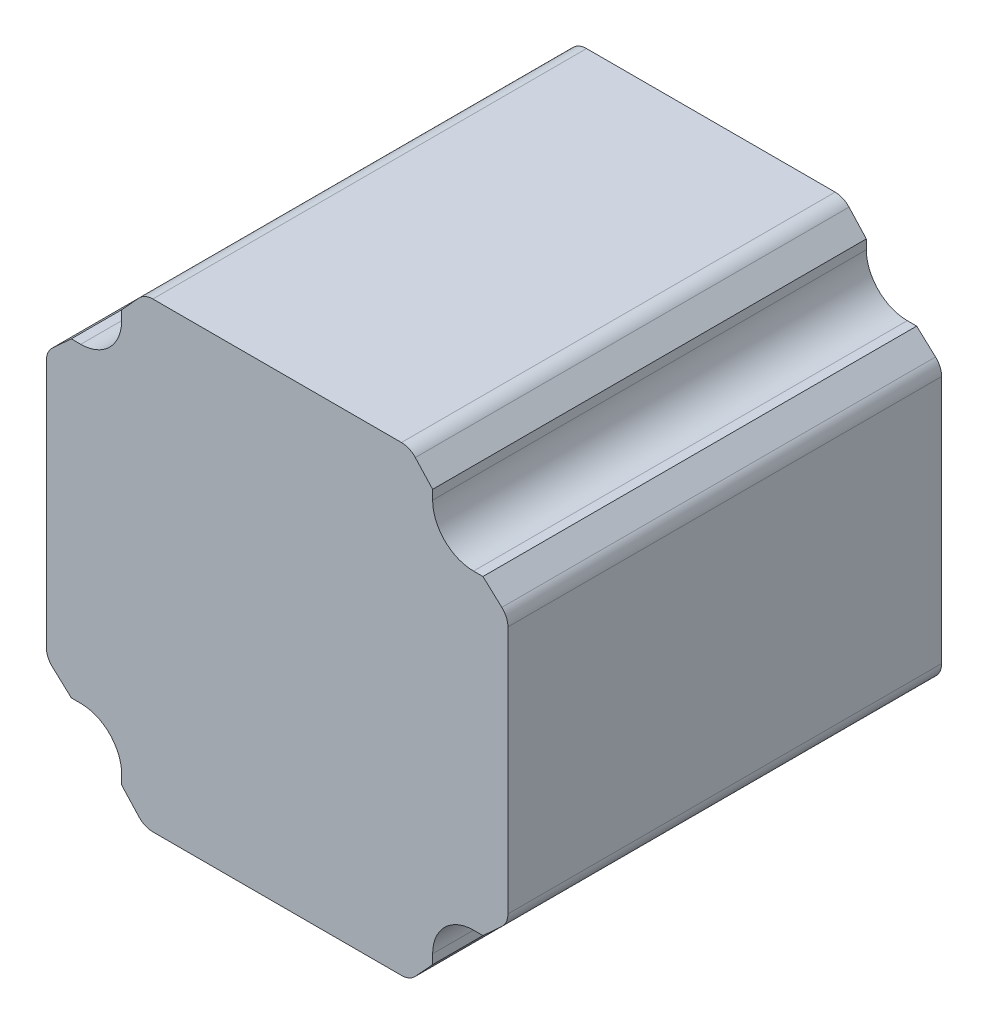
ISO-10303-21;
HEADER;
FILE_DESCRIPTION(('STEP AP214'),'2;1');
FILE_NAME('part.step','',(''),(''),'','','');
FILE_SCHEMA(('AUTOMOTIVE_DESIGN { 1 0 10303 214 1 1 1 1 }'));
ENDSEC;
DATA;
#1=APPLICATION_CONTEXT('core data for automotive mechanical design processes');
#2=APPLICATION_PROTOCOL_DEFINITION('international standard','automotive_design',2000,#1);
#3=PRODUCT_CONTEXT('',#1,'mechanical');
#4=PRODUCT('Part','Part','',(#3));
#5=PRODUCT_RELATED_PRODUCT_CATEGORY('part','',(#4));
#6=PRODUCT_DEFINITION_FORMATION('','',#4);
#7=PRODUCT_DEFINITION_CONTEXT('part definition',#1,'design');
#8=PRODUCT_DEFINITION('design','',#6,#7);
#9=PRODUCT_DEFINITION_SHAPE('','',#8);
#10=(LENGTH_UNIT() NAMED_UNIT(*) SI_UNIT(.MILLI.,.METRE.));
#11=(NAMED_UNIT(*) PLANE_ANGLE_UNIT() SI_UNIT($,.RADIAN.));
#12=(NAMED_UNIT(*) SI_UNIT($,.STERADIAN.) SOLID_ANGLE_UNIT());
#13=UNCERTAINTY_MEASURE_WITH_UNIT(LENGTH_MEASURE(1.E-05),#10,'distance_accuracy_value','');
#14=(GEOMETRIC_REPRESENTATION_CONTEXT(3) GLOBAL_UNCERTAINTY_ASSIGNED_CONTEXT((#13)) GLOBAL_UNIT_ASSIGNED_CONTEXT((#10,
#11,#12)) REPRESENTATION_CONTEXT('',''));
#15=CARTESIAN_POINT('',(0.,0.,0.));
#16=DIRECTION('',(0.,0.,1.));
#17=DIRECTION('',(1.,0.,0.));
#18=AXIS2_PLACEMENT_3D('',#15,#16,#17);
#19=CARTESIAN_POINT('',(24.,19.,53.));
#20=DIRECTION('',(0.,-1.,0.));
#21=DIRECTION('',(0.,0.,-1.));
#22=AXIS2_PLACEMENT_3D('',#19,#20,#21);
#23=PLANE('',#22);
#24=DIRECTION('',(0.,0.,-1.));
#25=VECTOR('',#24,1.);
#26=CARTESIAN_POINT('',(24.,19.,53.));
#27=LINE('',#26,#25);
#28=CARTESIAN_POINT('',(24.,19.,0.));
#29=VERTEX_POINT('',#28);
#30=CARTESIAN_POINT('',(24.,19.,53.));
#31=VERTEX_POINT('',#30);
#32=EDGE_CURVE('E432',#29,#31,#27,.F.);
#33=ORIENTED_EDGE('',*,*,#32,.T.);
#34=DIRECTION('',(1.,0.,0.));
#35=VECTOR('',#34,1.);
#36=CARTESIAN_POINT('',(0.,19.,53.));
#37=LINE('',#36,#35);
#38=CARTESIAN_POINT('',(25.15,19.,53.));
#39=VERTEX_POINT('',#38);
#40=EDGE_CURVE('E264',#39,#31,#37,.F.);
#41=ORIENTED_EDGE('',*,*,#40,.F.);
#42=DIRECTION('',(0.,0.,1.));
#43=VECTOR('',#42,1.);
#44=CARTESIAN_POINT('',(25.15,19.,53.));
#45=LINE('',#44,#43);
#46=CARTESIAN_POINT('',(25.15,19.,0.));
#47=VERTEX_POINT('',#46);
#48=EDGE_CURVE('E224',#39,#47,#45,.F.);
#49=ORIENTED_EDGE('',*,*,#48,.T.);
#50=DIRECTION('',(1.,0.,0.));
#51=VECTOR('',#50,1.);
#52=CARTESIAN_POINT('',(24.,19.,0.));
#53=LINE('',#52,#51);
#54=EDGE_CURVE('E354',#29,#47,#53,.T.);
#55=ORIENTED_EDGE('',*,*,#54,.F.);
#56=EDGE_LOOP('',(#33,#41,#49,#55));
#57=FACE_BOUND('',#56,.T.);
#58=ADVANCED_FACE('F17',(#57),#23,.F.);
#59=CARTESIAN_POINT('',(19.,25.15,53.));
#60=DIRECTION('',(-1.,0.,0.));
#61=DIRECTION('',(0.,0.,1.));
#62=AXIS2_PLACEMENT_3D('',#59,#60,#61);
#63=PLANE('',#62);
#64=DIRECTION('',(0.,0.,1.));
#65=VECTOR('',#64,1.);
#66=CARTESIAN_POINT('',(19.,25.15,53.));
#67=LINE('',#66,#65);
#68=CARTESIAN_POINT('',(19.,25.15,0.));
#69=VERTEX_POINT('',#68);
#70=CARTESIAN_POINT('',(19.,25.15,53.));
#71=VERTEX_POINT('',#70);
#72=EDGE_CURVE('E350',#69,#71,#67,.T.);
#73=ORIENTED_EDGE('',*,*,#72,.T.);
#74=DIRECTION('',(0.,1.,0.));
#75=VECTOR('',#74,1.);
#76=CARTESIAN_POINT('',(19.,0.,53.));
#77=LINE('',#76,#75);
#78=CARTESIAN_POINT('',(19.,24.,53.));
#79=VERTEX_POINT('',#78);
#80=EDGE_CURVE('E259',#79,#71,#77,.T.);
#81=ORIENTED_EDGE('',*,*,#80,.F.);
#82=DIRECTION('',(0.,0.,-1.));
#83=VECTOR('',#82,1.);
#84=CARTESIAN_POINT('',(19.,24.,53.));
#85=LINE('',#84,#83);
#86=CARTESIAN_POINT('',(19.,24.,0.));
#87=VERTEX_POINT('',#86);
#88=EDGE_CURVE('E431',#79,#87,#85,.T.);
#89=ORIENTED_EDGE('',*,*,#88,.T.);
#90=DIRECTION('',(0.,1.,0.));
#91=VECTOR('',#90,1.);
#92=CARTESIAN_POINT('',(19.,25.15,0.));
#93=LINE('',#92,#91);
#94=EDGE_CURVE('E332',#69,#87,#93,.F.);
#95=ORIENTED_EDGE('',*,*,#94,.F.);
#96=EDGE_LOOP('',(#73,#81,#89,#95));
#97=FACE_BOUND('',#96,.T.);
#98=ADVANCED_FACE('F516',(#97),#63,.F.);
#99=CARTESIAN_POINT('',(-19.,24.,53.));
#100=DIRECTION('',(1.,0.,0.));
#101=DIRECTION('',(0.,0.,-1.));
#102=AXIS2_PLACEMENT_3D('',#99,#100,#101);
#103=PLANE('',#102);
#104=DIRECTION('',(0.,0.,-1.));
#105=VECTOR('',#104,1.);
#106=CARTESIAN_POINT('',(-19.,24.,53.));
#107=LINE('',#106,#105);
#108=CARTESIAN_POINT('',(-19.,24.,0.));
#109=VERTEX_POINT('',#108);
#110=CARTESIAN_POINT('',(-19.,24.,53.));
#111=VERTEX_POINT('',#110);
#112=EDGE_CURVE('E426',#109,#111,#107,.F.);
#113=ORIENTED_EDGE('',*,*,#112,.T.);
#114=DIRECTION('',(0.,1.,0.));
#115=VECTOR('',#114,1.);
#116=CARTESIAN_POINT('',(-19.,0.,53.));
#117=LINE('',#116,#115);
#118=CARTESIAN_POINT('',(-19.,25.15,53.));
#119=VERTEX_POINT('',#118);
#120=EDGE_CURVE('E255',#119,#111,#117,.F.);
#121=ORIENTED_EDGE('',*,*,#120,.F.);
#122=DIRECTION('',(0.,0.,1.));
#123=VECTOR('',#122,1.);
#124=CARTESIAN_POINT('',(-19.,25.15,53.));
#125=LINE('',#124,#123);
#126=CARTESIAN_POINT('',(-19.,25.15,0.));
#127=VERTEX_POINT('',#126);
#128=EDGE_CURVE('E338',#119,#127,#125,.F.);
#129=ORIENTED_EDGE('',*,*,#128,.T.);
#130=DIRECTION('',(0.,1.,0.));
#131=VECTOR('',#130,1.);
#132=CARTESIAN_POINT('',(-19.,24.,0.));
#133=LINE('',#132,#131);
#134=EDGE_CURVE('E327',#109,#127,#133,.T.);
#135=ORIENTED_EDGE('',*,*,#134,.F.);
#136=EDGE_LOOP('',(#113,#121,#129,#135));
#137=FACE_BOUND('',#136,.T.);
#138=ADVANCED_FACE('F623',(#137),#103,.F.);
#139=CARTESIAN_POINT('',(-25.15,19.,53.));
#140=DIRECTION('',(0.,-1.,0.));
#141=DIRECTION('',(0.,0.,-1.));
#142=AXIS2_PLACEMENT_3D('',#139,#140,#141);
#143=PLANE('',#142);
#144=DIRECTION('',(0.,0.,1.));
#145=VECTOR('',#144,1.);
#146=CARTESIAN_POINT('',(-25.15,19.,53.));
#147=LINE('',#146,#145);
#148=CARTESIAN_POINT('',(-25.15,19.,0.));
#149=VERTEX_POINT('',#148);
#150=CARTESIAN_POINT('',(-25.15,19.,53.));
#151=VERTEX_POINT('',#150);
#152=EDGE_CURVE('E323',#149,#151,#147,.T.);
#153=ORIENTED_EDGE('',*,*,#152,.T.);
#154=DIRECTION('',(1.,0.,0.));
#155=VECTOR('',#154,1.);
#156=CARTESIAN_POINT('',(0.,19.,53.));
#157=LINE('',#156,#155);
#158=CARTESIAN_POINT('',(-24.,19.,53.));
#159=VERTEX_POINT('',#158);
#160=EDGE_CURVE('E250',#159,#151,#157,.F.);
#161=ORIENTED_EDGE('',*,*,#160,.F.);
#162=DIRECTION('',(0.,0.,-1.));
#163=VECTOR('',#162,1.);
#164=CARTESIAN_POINT('',(-24.,19.,53.));
#165=LINE('',#164,#163);
#166=CARTESIAN_POINT('',(-24.,19.,0.));
#167=VERTEX_POINT('',#166);
#168=EDGE_CURVE('E425',#159,#167,#165,.T.);
#169=ORIENTED_EDGE('',*,*,#168,.T.);
#170=DIRECTION('',(1.,0.,0.));
#171=VECTOR('',#170,1.);
#172=CARTESIAN_POINT('',(-25.15,19.,0.));
#173=LINE('',#172,#171);
#174=EDGE_CURVE('E305',#149,#167,#173,.T.);
#175=ORIENTED_EDGE('',*,*,#174,.F.);
#176=EDGE_LOOP('',(#153,#161,#169,#175));
#177=FACE_BOUND('',#176,.T.);
#178=ADVANCED_FACE('F642',(#177),#143,.F.);
#179=CARTESIAN_POINT('',(-24.,-19.,53.));
#180=DIRECTION('',(0.,1.,0.));
#181=DIRECTION('',(0.,0.,1.));
#182=AXIS2_PLACEMENT_3D('',#179,#180,#181);
#183=PLANE('',#182);
#184=DIRECTION('',(0.,0.,-1.));
#185=VECTOR('',#184,1.);
#186=CARTESIAN_POINT('',(-24.,-19.,53.));
#187=LINE('',#186,#185);
#188=CARTESIAN_POINT('',(-24.,-19.,0.));
#189=VERTEX_POINT('',#188);
#190=CARTESIAN_POINT('',(-24.,-19.,53.));
#191=VERTEX_POINT('',#190);
#192=EDGE_CURVE('E418',#189,#191,#187,.F.);
#193=ORIENTED_EDGE('',*,*,#192,.T.);
#194=DIRECTION('',(1.,0.,0.));
#195=VECTOR('',#194,1.);
#196=CARTESIAN_POINT('',(0.,-19.,53.));
#197=LINE('',#196,#195);
#198=CARTESIAN_POINT('',(-25.15,-19.,53.));
#199=VERTEX_POINT('',#198);
#200=EDGE_CURVE('E246',#199,#191,#197,.T.);
#201=ORIENTED_EDGE('',*,*,#200,.F.);
#202=DIRECTION('',(0.,0.,1.));
#203=VECTOR('',#202,1.);
#204=CARTESIAN_POINT('',(-25.15,-19.,53.));
#205=LINE('',#204,#203);
#206=CARTESIAN_POINT('',(-25.15,-19.,0.));
#207=VERTEX_POINT('',#206);
#208=EDGE_CURVE('E311',#199,#207,#205,.F.);
#209=ORIENTED_EDGE('',*,*,#208,.T.);
#210=DIRECTION('',(1.,0.,0.));
#211=VECTOR('',#210,1.);
#212=CARTESIAN_POINT('',(-24.,-19.,0.));
#213=LINE('',#212,#211);
#214=EDGE_CURVE('E300',#189,#207,#213,.F.);
#215=ORIENTED_EDGE('',*,*,#214,.F.);
#216=EDGE_LOOP('',(#193,#201,#209,#215));
#217=FACE_BOUND('',#216,.T.);
#218=ADVANCED_FACE('F670',(#217),#183,.F.);
#219=CARTESIAN_POINT('',(-19.,-25.15,53.));
#220=DIRECTION('',(1.,0.,0.));
#221=DIRECTION('',(0.,0.,-1.));
#222=AXIS2_PLACEMENT_3D('',#219,#220,#221);
#223=PLANE('',#222);
#224=DIRECTION('',(0.,0.,1.));
#225=VECTOR('',#224,1.);
#226=CARTESIAN_POINT('',(-19.,-25.15,53.));
#227=LINE('',#226,#225);
#228=CARTESIAN_POINT('',(-19.,-25.15,0.));
#229=VERTEX_POINT('',#228);
#230=CARTESIAN_POINT('',(-19.,-25.15,53.));
#231=VERTEX_POINT('',#230);
#232=EDGE_CURVE('E296',#229,#231,#227,.T.);
#233=ORIENTED_EDGE('',*,*,#232,.T.);
#234=DIRECTION('',(0.,1.,0.));
#235=VECTOR('',#234,1.);
#236=CARTESIAN_POINT('',(-19.,0.,53.));
#237=LINE('',#236,#235);
#238=CARTESIAN_POINT('',(-19.,-24.,53.));
#239=VERTEX_POINT('',#238);
#240=EDGE_CURVE('E241',#239,#231,#237,.F.);
#241=ORIENTED_EDGE('',*,*,#240,.F.);
#242=DIRECTION('',(0.,0.,-1.));
#243=VECTOR('',#242,1.);
#244=CARTESIAN_POINT('',(-19.,-24.,53.));
#245=LINE('',#244,#243);
#246=CARTESIAN_POINT('',(-19.,-24.,0.));
#247=VERTEX_POINT('',#246);
#248=EDGE_CURVE('E417',#239,#247,#245,.T.);
#249=ORIENTED_EDGE('',*,*,#248,.T.);
#250=DIRECTION('',(0.,1.,0.));
#251=VECTOR('',#250,1.);
#252=CARTESIAN_POINT('',(-19.,-25.15,0.));
#253=LINE('',#252,#251);
#254=EDGE_CURVE('E277',#229,#247,#253,.T.);
#255=ORIENTED_EDGE('',*,*,#254,.F.);
#256=EDGE_LOOP('',(#233,#241,#249,#255));
#257=FACE_BOUND('',#256,.T.);
#258=ADVANCED_FACE('F604',(#257),#223,.F.);
#259=CARTESIAN_POINT('',(19.,-24.,53.));
#260=DIRECTION('',(-1.,0.,0.));
#261=DIRECTION('',(0.,0.,1.));
#262=AXIS2_PLACEMENT_3D('',#259,#260,#261);
#263=PLANE('',#262);
#264=DIRECTION('',(0.,0.,-1.));
#265=VECTOR('',#264,1.);
#266=CARTESIAN_POINT('',(19.,-24.,53.));
#267=LINE('',#266,#265);
#268=CARTESIAN_POINT('',(19.,-24.,0.));
#269=VERTEX_POINT('',#268);
#270=CARTESIAN_POINT('',(19.,-24.,53.));
#271=VERTEX_POINT('',#270);
#272=EDGE_CURVE('E410',#269,#271,#267,.F.);
#273=ORIENTED_EDGE('',*,*,#272,.T.);
#274=DIRECTION('',(0.,1.,0.));
#275=VECTOR('',#274,1.);
#276=CARTESIAN_POINT('',(19.,0.,53.));
#277=LINE('',#276,#275);
#278=CARTESIAN_POINT('',(19.,-25.15,53.));
#279=VERTEX_POINT('',#278);
#280=EDGE_CURVE('E237',#279,#271,#277,.T.);
#281=ORIENTED_EDGE('',*,*,#280,.F.);
#282=DIRECTION('',(0.,0.,1.));
#283=VECTOR('',#282,1.);
#284=CARTESIAN_POINT('',(19.,-25.15,53.));
#285=LINE('',#284,#283);
#286=CARTESIAN_POINT('',(19.,-25.15,0.));
#287=VERTEX_POINT('',#286);
#288=EDGE_CURVE('E283',#279,#287,#285,.F.);
#289=ORIENTED_EDGE('',*,*,#288,.T.);
#290=DIRECTION('',(0.,1.,0.));
#291=VECTOR('',#290,1.);
#292=CARTESIAN_POINT('',(19.,-24.,0.));
#293=LINE('',#292,#291);
#294=EDGE_CURVE('E272',#269,#287,#293,.F.);
#295=ORIENTED_EDGE('',*,*,#294,.F.);
#296=EDGE_LOOP('',(#273,#281,#289,#295));
#297=FACE_BOUND('',#296,.T.);
#298=ADVANCED_FACE('F580',(#297),#263,.F.);
#299=CARTESIAN_POINT('',(25.15,-19.,53.));
#300=DIRECTION('',(0.,1.,0.));
#301=DIRECTION('',(0.,0.,1.));
#302=AXIS2_PLACEMENT_3D('',#299,#300,#301);
#303=PLANE('',#302);
#304=DIRECTION('',(0.,0.,1.));
#305=VECTOR('',#304,1.);
#306=CARTESIAN_POINT('',(25.15,-19.,53.));
#307=LINE('',#306,#305);
#308=CARTESIAN_POINT('',(25.15,-19.,0.));
#309=VERTEX_POINT('',#308);
#310=CARTESIAN_POINT('',(25.15,-19.,53.));
#311=VERTEX_POINT('',#310);
#312=EDGE_CURVE('E233',#309,#311,#307,.T.);
#313=ORIENTED_EDGE('',*,*,#312,.T.);
#314=DIRECTION('',(1.,0.,0.));
#315=VECTOR('',#314,1.);
#316=CARTESIAN_POINT('',(0.,-19.,53.));
#317=LINE('',#316,#315);
#318=CARTESIAN_POINT('',(24.,-19.,53.));
#319=VERTEX_POINT('',#318);
#320=EDGE_CURVE('E218',#319,#311,#317,.T.);
#321=ORIENTED_EDGE('',*,*,#320,.F.);
#322=DIRECTION('',(0.,0.,-1.));
#323=VECTOR('',#322,1.);
#324=CARTESIAN_POINT('',(24.,-19.,53.));
#325=LINE('',#324,#323);
#326=CARTESIAN_POINT('',(24.,-19.,0.));
#327=VERTEX_POINT('',#326);
#328=EDGE_CURVE('E409',#319,#327,#325,.T.);
#329=ORIENTED_EDGE('',*,*,#328,.T.);
#330=DIRECTION('',(1.,0.,0.));
#331=VECTOR('',#330,1.);
#332=CARTESIAN_POINT('',(25.15,-19.,0.));
#333=LINE('',#332,#331);
#334=EDGE_CURVE('E268',#309,#327,#333,.F.);
#335=ORIENTED_EDGE('',*,*,#334,.F.);
#336=EDGE_LOOP('',(#313,#321,#329,#335));
#337=FACE_BOUND('',#336,.T.);
#338=ADVANCED_FACE('F568',(#337),#303,.F.);
#339=CARTESIAN_POINT('',(0.,0.,53.));
#340=DIRECTION('',(0.,0.,1.));
#341=DIRECTION('',(1.,0.,0.));
#342=AXIS2_PLACEMENT_3D('',#339,#340,#341);
#343=PLANE('',#342);
#344=ORIENTED_EDGE('',*,*,#320,.T.);
#345=DIRECTION('',(-0.736652658103118,-0.67627129268483,0.));
#346=VECTOR('',#345,1.);
#347=CARTESIAN_POINT('',(28.2,-16.2,53.));
#348=LINE('',#347,#346);
#349=CARTESIAN_POINT('',(27.4554239731751,-16.883545204954,53.));
#350=VERTEX_POINT('',#349);
#351=EDGE_CURVE('E230',#311,#350,#348,.F.);
#352=ORIENTED_EDGE('',*,*,#351,.T.);
#353=CARTESIAN_POINT('',(25.9,-15.1892440913168,53.));
#354=DIRECTION('',(0.,0.,-1.));
#355=DIRECTION('',(-1.,0.,0.));
#356=AXIS2_PLACEMENT_3D('',#353,#354,#355);
#357=CIRCLE('',#356,2.3);
#358=CARTESIAN_POINT('',(28.2,-15.1892440913168,53.));
#359=VERTEX_POINT('',#358);
#360=EDGE_CURVE('E214',#359,#350,#357,.T.);
#361=ORIENTED_EDGE('',*,*,#360,.F.);
#362=DIRECTION('',(0.,1.,0.));
#363=VECTOR('',#362,1.);
#364=CARTESIAN_POINT('',(28.2,28.2,53.));
#365=LINE('',#364,#363);
#366=CARTESIAN_POINT('',(28.2,15.1892440913168,53.));
#367=VERTEX_POINT('',#366);
#368=EDGE_CURVE('E209',#367,#359,#365,.F.);
#369=ORIENTED_EDGE('',*,*,#368,.F.);
#370=CARTESIAN_POINT('',(25.9,15.1892440913168,53.));
#371=DIRECTION('',(0.,0.,1.));
#372=DIRECTION('',(1.,0.,0.));
#373=AXIS2_PLACEMENT_3D('',#370,#371,#372);
#374=CIRCLE('',#373,2.3);
#375=CARTESIAN_POINT('',(27.4554239731751,16.883545204954,53.));
#376=VERTEX_POINT('',#375);
#377=EDGE_CURVE('E20',#376,#367,#374,.F.);
#378=ORIENTED_EDGE('',*,*,#377,.F.);
#379=DIRECTION('',(0.736652658103118,-0.67627129268483,0.));
#380=VECTOR('',#379,1.);
#381=CARTESIAN_POINT('',(25.15,19.,53.));
#382=LINE('',#381,#380);
#383=EDGE_CURVE('E194',#376,#39,#382,.F.);
#384=ORIENTED_EDGE('',*,*,#383,.T.);
#385=ORIENTED_EDGE('',*,*,#40,.T.);
#386=CARTESIAN_POINT('',(24.,24.,53.));
#387=DIRECTION('',(0.,0.,-1.));
#388=DIRECTION('',(-1.,0.,0.));
#389=AXIS2_PLACEMENT_3D('',#386,#387,#388);
#390=CIRCLE('',#389,5.);
#391=EDGE_CURVE('E429',#31,#79,#390,.T.);
#392=ORIENTED_EDGE('',*,*,#391,.T.);
#393=ORIENTED_EDGE('',*,*,#80,.T.);
#394=DIRECTION('',(0.67627129268483,-0.736652658103118,0.));
#395=VECTOR('',#394,1.);
#396=CARTESIAN_POINT('',(16.2,28.2,53.));
#397=LINE('',#396,#395);
#398=CARTESIAN_POINT('',(16.883545204954,27.4554239731751,53.));
#399=VERTEX_POINT('',#398);
#400=EDGE_CURVE('E346',#71,#399,#397,.F.);
#401=ORIENTED_EDGE('',*,*,#400,.T.);
#402=CARTESIAN_POINT('',(15.1892440913168,25.9,53.));
#403=DIRECTION('',(0.,0.,-1.));
#404=DIRECTION('',(-1.,0.,0.));
#405=AXIS2_PLACEMENT_3D('',#402,#403,#404);
#406=CIRCLE('',#405,2.3);
#407=CARTESIAN_POINT('',(15.1892440913168,28.2,53.));
#408=VERTEX_POINT('',#407);
#409=EDGE_CURVE('E349',#408,#399,#406,.T.);
#410=ORIENTED_EDGE('',*,*,#409,.F.);
#411=DIRECTION('',(1.,0.,0.));
#412=VECTOR('',#411,1.);
#413=CARTESIAN_POINT('',(-28.2,28.2,53.));
#414=LINE('',#413,#412);
#415=CARTESIAN_POINT('',(-15.1892440913168,28.2,53.));
#416=VERTEX_POINT('',#415);
#417=EDGE_CURVE('E342',#416,#408,#414,.T.);
#418=ORIENTED_EDGE('',*,*,#417,.F.);
#419=CARTESIAN_POINT('',(-15.1892440913168,25.9,53.));
#420=DIRECTION('',(0.,0.,1.));
#421=DIRECTION('',(1.,0.,0.));
#422=AXIS2_PLACEMENT_3D('',#419,#420,#421);
#423=CIRCLE('',#422,2.3);
#424=CARTESIAN_POINT('',(-16.883545204954,27.4554239731751,53.));
#425=VERTEX_POINT('',#424);
#426=EDGE_CURVE('E427',#425,#416,#423,.F.);
#427=ORIENTED_EDGE('',*,*,#426,.F.);
#428=DIRECTION('',(0.67627129268483,0.736652658103118,0.));
#429=VECTOR('',#428,1.);
#430=CARTESIAN_POINT('',(-19.,25.15,53.));
#431=LINE('',#430,#429);
#432=EDGE_CURVE('E335',#425,#119,#431,.F.);
#433=ORIENTED_EDGE('',*,*,#432,.T.);
#434=ORIENTED_EDGE('',*,*,#120,.T.);
#435=CARTESIAN_POINT('',(-24.,24.,53.));
#436=DIRECTION('',(0.,0.,-1.));
#437=DIRECTION('',(-1.,0.,0.));
#438=AXIS2_PLACEMENT_3D('',#435,#436,#437);
#439=CIRCLE('',#438,5.);
#440=EDGE_CURVE('E422',#111,#159,#439,.T.);
#441=ORIENTED_EDGE('',*,*,#440,.T.);
#442=ORIENTED_EDGE('',*,*,#160,.T.);
#443=DIRECTION('',(0.736652658103118,0.67627129268483,0.));
#444=VECTOR('',#443,1.);
#445=CARTESIAN_POINT('',(-28.2,16.2,53.));
#446=LINE('',#445,#444);
#447=CARTESIAN_POINT('',(-27.4554239731751,16.883545204954,53.));
#448=VERTEX_POINT('',#447);
#449=EDGE_CURVE('E319',#151,#448,#446,.F.);
#450=ORIENTED_EDGE('',*,*,#449,.T.);
#451=CARTESIAN_POINT('',(-25.9,15.1892440913168,53.));
#452=DIRECTION('',(0.,0.,-1.));
#453=DIRECTION('',(-1.,0.,0.));
#454=AXIS2_PLACEMENT_3D('',#451,#452,#453);
#455=CIRCLE('',#454,2.3);
#456=CARTESIAN_POINT('',(-28.2,15.1892440913168,53.));
#457=VERTEX_POINT('',#456);
#458=EDGE_CURVE('E322',#457,#448,#455,.T.);
#459=ORIENTED_EDGE('',*,*,#458,.F.);
#460=DIRECTION('',(0.,1.,0.));
#461=VECTOR('',#460,1.);
#462=CARTESIAN_POINT('',(-28.2,-28.2,53.));
#463=LINE('',#462,#461);
#464=CARTESIAN_POINT('',(-28.2,-15.1892440913168,53.));
#465=VERTEX_POINT('',#464);
#466=EDGE_CURVE('E315',#465,#457,#463,.T.);
#467=ORIENTED_EDGE('',*,*,#466,.F.);
#468=CARTESIAN_POINT('',(-25.9,-15.1892440913168,53.));
#469=DIRECTION('',(0.,0.,1.));
#470=DIRECTION('',(1.,0.,0.));
#471=AXIS2_PLACEMENT_3D('',#468,#469,#470);
#472=CIRCLE('',#471,2.3);
#473=CARTESIAN_POINT('',(-27.4554239731751,-16.883545204954,53.));
#474=VERTEX_POINT('',#473);
#475=EDGE_CURVE('E419',#474,#465,#472,.F.);
#476=ORIENTED_EDGE('',*,*,#475,.F.);
#477=DIRECTION('',(-0.736652658103118,0.67627129268483,0.));
#478=VECTOR('',#477,1.);
#479=CARTESIAN_POINT('',(-25.15,-19.,53.));
#480=LINE('',#479,#478);
#481=EDGE_CURVE('E308',#474,#199,#480,.F.);
#482=ORIENTED_EDGE('',*,*,#481,.T.);
#483=ORIENTED_EDGE('',*,*,#200,.T.);
#484=CARTESIAN_POINT('',(-24.,-24.,53.));
#485=DIRECTION('',(0.,0.,-1.));
#486=DIRECTION('',(-1.,0.,0.));
#487=AXIS2_PLACEMENT_3D('',#484,#485,#486);
#488=CIRCLE('',#487,5.);
#489=EDGE_CURVE('E414',#191,#239,#488,.T.);
#490=ORIENTED_EDGE('',*,*,#489,.T.);
#491=ORIENTED_EDGE('',*,*,#240,.T.);
#492=DIRECTION('',(-0.67627129268483,0.736652658103118,0.));
#493=VECTOR('',#492,1.);
#494=CARTESIAN_POINT('',(-16.2,-28.2,53.));
#495=LINE('',#494,#493);
#496=CARTESIAN_POINT('',(-16.883545204954,-27.4554239731751,53.));
#497=VERTEX_POINT('',#496);
#498=EDGE_CURVE('E292',#231,#497,#495,.F.);
#499=ORIENTED_EDGE('',*,*,#498,.T.);
#500=CARTESIAN_POINT('',(-15.1892440913168,-25.9,53.));
#501=DIRECTION('',(0.,0.,-1.));
#502=DIRECTION('',(-1.,0.,0.));
#503=AXIS2_PLACEMENT_3D('',#500,#501,#502);
#504=CIRCLE('',#503,2.3);
#505=CARTESIAN_POINT('',(-15.1892440913168,-28.2,53.));
#506=VERTEX_POINT('',#505);
#507=EDGE_CURVE('E295',#506,#497,#504,.T.);
#508=ORIENTED_EDGE('',*,*,#507,.F.);
#509=DIRECTION('',(1.,0.,0.));
#510=VECTOR('',#509,1.);
#511=CARTESIAN_POINT('',(28.2,-28.2,53.));
#512=LINE('',#511,#510);
#513=CARTESIAN_POINT('',(15.1892440913168,-28.2,53.));
#514=VERTEX_POINT('',#513);
#515=EDGE_CURVE('E287',#514,#506,#512,.F.);
#516=ORIENTED_EDGE('',*,*,#515,.F.);
#517=CARTESIAN_POINT('',(15.1892440913168,-25.9,53.));
#518=DIRECTION('',(0.,0.,1.));
#519=DIRECTION('',(1.,0.,0.));
#520=AXIS2_PLACEMENT_3D('',#517,#518,#519);
#521=CIRCLE('',#520,2.3);
#522=CARTESIAN_POINT('',(16.883545204954,-27.4554239731751,53.));
#523=VERTEX_POINT('',#522);
#524=EDGE_CURVE('E290',#523,#514,#521,.F.);
#525=ORIENTED_EDGE('',*,*,#524,.F.);
#526=DIRECTION('',(-0.67627129268483,-0.736652658103118,0.));
#527=VECTOR('',#526,1.);
#528=CARTESIAN_POINT('',(19.,-25.15,53.));
#529=LINE('',#528,#527);
#530=EDGE_CURVE('E280',#523,#279,#529,.F.);
#531=ORIENTED_EDGE('',*,*,#530,.T.);
#532=ORIENTED_EDGE('',*,*,#280,.T.);
#533=CARTESIAN_POINT('',(24.,-24.,53.));
#534=DIRECTION('',(0.,0.,-1.));
#535=DIRECTION('',(-1.,0.,0.));
#536=AXIS2_PLACEMENT_3D('',#533,#534,#535);
#537=CIRCLE('',#536,5.);
#538=EDGE_CURVE('E406',#271,#319,#537,.T.);
#539=ORIENTED_EDGE('',*,*,#538,.T.);
#540=EDGE_LOOP('',(#344,#352,#361,#369,#378,#384,#385,#392,#393,#401,#410,#418,#427,#433,#434,
#441,#442,#450,#459,#467,#476,#482,#483,#490,#491,#499,#508,#516,#525,#531,#532,#539));
#541=FACE_BOUND('',#540,.T.);
#542=ADVANCED_FACE('F212',(#541),#343,.T.);
#543=CARTESIAN_POINT('',(28.2,28.2,0.));
#544=DIRECTION('',(1.,0.,0.));
#545=DIRECTION('',(0.,0.,-1.));
#546=AXIS2_PLACEMENT_3D('',#543,#544,#545);
#547=PLANE('',#546);
#548=DIRECTION('',(0.,0.,1.));
#549=VECTOR('',#548,1.);
#550=CARTESIAN_POINT('',(28.2,15.1892440913168,26.5));
#551=LINE('',#550,#549);
#552=CARTESIAN_POINT('',(28.2,15.1892440913168,0.));
#553=VERTEX_POINT('',#552);
#554=EDGE_CURVE('E205',#367,#553,#551,.F.);
#555=ORIENTED_EDGE('',*,*,#554,.F.);
#556=ORIENTED_EDGE('',*,*,#368,.T.);
#557=DIRECTION('',(0.,0.,-1.));
#558=VECTOR('',#557,1.);
#559=CARTESIAN_POINT('',(28.2,-15.1892440913168,26.5));
#560=LINE('',#559,#558);
#561=CARTESIAN_POINT('',(28.2,-15.1892440913168,0.));
#562=VERTEX_POINT('',#561);
#563=EDGE_CURVE('E232',#562,#359,#560,.F.);
#564=ORIENTED_EDGE('',*,*,#563,.F.);
#565=DIRECTION('',(0.,1.,0.));
#566=VECTOR('',#565,1.);
#567=CARTESIAN_POINT('',(28.2,0.,0.));
#568=LINE('',#567,#566);
#569=EDGE_CURVE('E222',#562,#553,#568,.T.);
#570=ORIENTED_EDGE('',*,*,#569,.T.);
#571=EDGE_LOOP('',(#555,#556,#564,#570));
#572=FACE_BOUND('',#571,.T.);
#573=ADVANCED_FACE('F221',(#572),#547,.T.);
#574=CARTESIAN_POINT('',(25.9,15.1892440913168,26.5));
#575=DIRECTION('',(0.,0.,1.));
#576=DIRECTION('',(1.,0.,0.));
#577=AXIS2_PLACEMENT_3D('',#574,#575,#576);
#578=CYLINDRICAL_SURFACE('',#577,2.3);
#579=CARTESIAN_POINT('',(25.9,15.1892440913168,0.));
#580=DIRECTION('',(0.,0.,1.));
#581=DIRECTION('',(1.,0.,0.));
#582=AXIS2_PLACEMENT_3D('',#579,#580,#581);
#583=CIRCLE('',#582,2.3);
#584=CARTESIAN_POINT('',(27.4554239731751,16.883545204954,0.));
#585=VERTEX_POINT('',#584);
#586=EDGE_CURVE('E403',#553,#585,#583,.T.);
#587=ORIENTED_EDGE('',*,*,#586,.T.);
#588=DIRECTION('',(0.,0.,1.));
#589=VECTOR('',#588,1.);
#590=CARTESIAN_POINT('',(27.4554239731751,16.883545204954,53.));
#591=LINE('',#590,#589);
#592=EDGE_CURVE('E207',#585,#376,#591,.T.);
#593=ORIENTED_EDGE('',*,*,#592,.T.);
#594=ORIENTED_EDGE('',*,*,#377,.T.);
#595=ORIENTED_EDGE('',*,*,#554,.T.);
#596=EDGE_LOOP('',(#587,#593,#594,#595));
#597=FACE_BOUND('',#596,.T.);
#598=ADVANCED_FACE('F203',(#597),#578,.T.);
#599=CARTESIAN_POINT('',(25.15,19.,53.));
#600=DIRECTION('',(-0.67627129268483,-0.736652658103118,0.));
#601=DIRECTION('',(0.736652658103118,-0.67627129268483,0.));
#602=AXIS2_PLACEMENT_3D('',#599,#600,#601);
#603=PLANE('',#602);
#604=DIRECTION('',(-0.736652658103119,0.676271292684828,0.));
#605=VECTOR('',#604,1.);
#606=CARTESIAN_POINT('',(27.4554239731751,16.883545204954,0.));
#607=LINE('',#606,#605);
#608=EDGE_CURVE('E402',#585,#47,#607,.T.);
#609=ORIENTED_EDGE('',*,*,#608,.T.);
#610=ORIENTED_EDGE('',*,*,#48,.F.);
#611=ORIENTED_EDGE('',*,*,#383,.F.);
#612=ORIENTED_EDGE('',*,*,#592,.F.);
#613=EDGE_LOOP('',(#609,#610,#611,#612));
#614=FACE_BOUND('',#613,.T.);
#615=ADVANCED_FACE('F445',(#614),#603,.F.);
#616=CARTESIAN_POINT('',(24.,24.,53.));
#617=DIRECTION('',(0.,0.,-1.));
#618=DIRECTION('',(-1.,0.,0.));
#619=AXIS2_PLACEMENT_3D('',#616,#617,#618);
#620=CYLINDRICAL_SURFACE('',#619,5.);
#621=ORIENTED_EDGE('',*,*,#88,.F.);
#622=ORIENTED_EDGE('',*,*,#391,.F.);
#623=ORIENTED_EDGE('',*,*,#32,.F.);
#624=CARTESIAN_POINT('',(24.,24.,0.));
#625=DIRECTION('',(0.,0.,-1.));
#626=DIRECTION('',(-1.,0.,0.));
#627=AXIS2_PLACEMENT_3D('',#624,#625,#626);
#628=CIRCLE('',#627,5.);
#629=EDGE_CURVE('E399',#29,#87,#628,.T.);
#630=ORIENTED_EDGE('',*,*,#629,.T.);
#631=EDGE_LOOP('',(#621,#622,#623,#630));
#632=FACE_BOUND('',#631,.T.);
#633=ADVANCED_FACE('F838',(#632),#620,.F.);
#634=CARTESIAN_POINT('',(16.2,28.2,53.));
#635=DIRECTION('',(-0.736652658103118,-0.67627129268483,0.));
#636=DIRECTION('',(0.67627129268483,-0.736652658103118,0.));
#637=AXIS2_PLACEMENT_3D('',#634,#635,#636);
#638=PLANE('',#637);
#639=ORIENTED_EDGE('',*,*,#400,.F.);
#640=ORIENTED_EDGE('',*,*,#72,.F.);
#641=DIRECTION('',(-0.676271292684827,0.736652658103121,0.));
#642=VECTOR('',#641,1.);
#643=CARTESIAN_POINT('',(19.,25.15,0.));
#644=LINE('',#643,#642);
#645=CARTESIAN_POINT('',(16.883545204954,27.4554239731751,0.));
#646=VERTEX_POINT('',#645);
#647=EDGE_CURVE('E398',#69,#646,#644,.T.);
#648=ORIENTED_EDGE('',*,*,#647,.T.);
#649=DIRECTION('',(0.,0.,-1.));
#650=VECTOR('',#649,1.);
#651=CARTESIAN_POINT('',(16.883545204954,27.4554239731751,26.5));
#652=LINE('',#651,#650);
#653=EDGE_CURVE('E345',#399,#646,#652,.T.);
#654=ORIENTED_EDGE('',*,*,#653,.F.);
#655=EDGE_LOOP('',(#639,#640,#648,#654));
#656=FACE_BOUND('',#655,.T.);
#657=ADVANCED_FACE('F523',(#656),#638,.F.);
#658=CARTESIAN_POINT('',(15.1892440913168,25.9,26.5));
#659=DIRECTION('',(0.,0.,-1.));
#660=DIRECTION('',(-1.,0.,0.));
#661=AXIS2_PLACEMENT_3D('',#658,#659,#660);
#662=CYLINDRICAL_SURFACE('',#661,2.3);
#663=ORIENTED_EDGE('',*,*,#409,.T.);
#664=ORIENTED_EDGE('',*,*,#653,.T.);
#665=CARTESIAN_POINT('',(15.1892440913168,25.9,0.));
#666=DIRECTION('',(0.,0.,-1.));
#667=DIRECTION('',(-1.,0.,0.));
#668=AXIS2_PLACEMENT_3D('',#665,#666,#667);
#669=CIRCLE('',#668,2.3);
#670=CARTESIAN_POINT('',(15.1892440913168,28.2,0.));
#671=VERTEX_POINT('',#670);
#672=EDGE_CURVE('E395',#646,#671,#669,.F.);
#673=ORIENTED_EDGE('',*,*,#672,.T.);
#674=DIRECTION('',(0.,0.,1.));
#675=VECTOR('',#674,1.);
#676=CARTESIAN_POINT('',(15.1892440913168,28.2,0.));
#677=LINE('',#676,#675);
#678=EDGE_CURVE('E344',#408,#671,#677,.F.);
#679=ORIENTED_EDGE('',*,*,#678,.F.);
#680=EDGE_LOOP('',(#663,#664,#673,#679));
#681=FACE_BOUND('',#680,.T.);
#682=ADVANCED_FACE('F636',(#681),#662,.T.);
#683=CARTESIAN_POINT('',(-28.2,28.2,0.));
#684=DIRECTION('',(0.,1.,0.));
#685=DIRECTION('',(0.,0.,1.));
#686=AXIS2_PLACEMENT_3D('',#683,#684,#685);
#687=PLANE('',#686);
#688=ORIENTED_EDGE('',*,*,#678,.T.);
#689=DIRECTION('',(1.,0.,0.));
#690=VECTOR('',#689,1.);
#691=CARTESIAN_POINT('',(0.,28.2,0.));
#692=LINE('',#691,#690);
#693=CARTESIAN_POINT('',(-15.1892440913168,28.2,0.));
#694=VERTEX_POINT('',#693);
#695=EDGE_CURVE('E394',#671,#694,#692,.F.);
#696=ORIENTED_EDGE('',*,*,#695,.T.);
#697=DIRECTION('',(0.,0.,1.));
#698=VECTOR('',#697,1.);
#699=CARTESIAN_POINT('',(-15.1892440913168,28.2,26.5));
#700=LINE('',#699,#698);
#701=EDGE_CURVE('E339',#416,#694,#700,.F.);
#702=ORIENTED_EDGE('',*,*,#701,.F.);
#703=ORIENTED_EDGE('',*,*,#417,.T.);
#704=EDGE_LOOP('',(#688,#696,#702,#703));
#705=FACE_BOUND('',#704,.T.);
#706=ADVANCED_FACE('F632',(#705),#687,.T.);
#707=CARTESIAN_POINT('',(-15.1892440913168,25.9,26.5));
#708=DIRECTION('',(0.,0.,1.));
#709=DIRECTION('',(1.,0.,0.));
#710=AXIS2_PLACEMENT_3D('',#707,#708,#709);
#711=CYLINDRICAL_SURFACE('',#710,2.3);
#712=CARTESIAN_POINT('',(-15.1892440913168,25.9,0.));
#713=DIRECTION('',(0.,0.,1.));
#714=DIRECTION('',(1.,0.,0.));
#715=AXIS2_PLACEMENT_3D('',#712,#713,#714);
#716=CIRCLE('',#715,2.3);
#717=CARTESIAN_POINT('',(-16.883545204954,27.4554239731751,0.));
#718=VERTEX_POINT('',#717);
#719=EDGE_CURVE('E391',#694,#718,#716,.T.);
#720=ORIENTED_EDGE('',*,*,#719,.T.);
#721=DIRECTION('',(0.,0.,1.));
#722=VECTOR('',#721,1.);
#723=CARTESIAN_POINT('',(-16.883545204954,27.4554239731751,53.));
#724=LINE('',#723,#722);
#725=EDGE_CURVE('E501',#718,#425,#724,.T.);
#726=ORIENTED_EDGE('',*,*,#725,.T.);
#727=ORIENTED_EDGE('',*,*,#426,.T.);
#728=ORIENTED_EDGE('',*,*,#701,.T.);
#729=EDGE_LOOP('',(#720,#726,#727,#728));
#730=FACE_BOUND('',#729,.T.);
#731=ADVANCED_FACE('F628',(#730),#711,.T.);
#732=CARTESIAN_POINT('',(-19.,25.15,53.));
#733=DIRECTION('',(0.736652658103118,-0.67627129268483,0.));
#734=DIRECTION('',(0.67627129268483,0.736652658103118,0.));
#735=AXIS2_PLACEMENT_3D('',#732,#733,#734);
#736=PLANE('',#735);
#737=DIRECTION('',(-0.676271292684829,-0.736652658103118,0.));
#738=VECTOR('',#737,1.);
#739=CARTESIAN_POINT('',(-16.883545204954,27.4554239731751,0.));
#740=LINE('',#739,#738);
#741=EDGE_CURVE('E390',#718,#127,#740,.T.);
#742=ORIENTED_EDGE('',*,*,#741,.T.);
#743=ORIENTED_EDGE('',*,*,#128,.F.);
#744=ORIENTED_EDGE('',*,*,#432,.F.);
#745=ORIENTED_EDGE('',*,*,#725,.F.);
#746=EDGE_LOOP('',(#742,#743,#744,#745));
#747=FACE_BOUND('',#746,.T.);
#748=ADVANCED_FACE('F625',(#747),#736,.F.);
#749=CARTESIAN_POINT('',(-24.,24.,53.));
#750=DIRECTION('',(0.,0.,-1.));
#751=DIRECTION('',(-1.,0.,0.));
#752=AXIS2_PLACEMENT_3D('',#749,#750,#751);
#753=CYLINDRICAL_SURFACE('',#752,5.);
#754=ORIENTED_EDGE('',*,*,#168,.F.);
#755=ORIENTED_EDGE('',*,*,#440,.F.);
#756=ORIENTED_EDGE('',*,*,#112,.F.);
#757=CARTESIAN_POINT('',(-24.,24.,0.));
#758=DIRECTION('',(0.,0.,-1.));
#759=DIRECTION('',(-1.,0.,0.));
#760=AXIS2_PLACEMENT_3D('',#757,#758,#759);
#761=CIRCLE('',#760,5.);
#762=EDGE_CURVE('E387',#109,#167,#761,.T.);
#763=ORIENTED_EDGE('',*,*,#762,.T.);
#764=EDGE_LOOP('',(#754,#755,#756,#763));
#765=FACE_BOUND('',#764,.T.);
#766=ADVANCED_FACE('F640',(#765),#753,.F.);
#767=CARTESIAN_POINT('',(-28.2,16.2,53.));
#768=DIRECTION('',(0.67627129268483,-0.736652658103118,0.));
#769=DIRECTION('',(0.736652658103118,0.67627129268483,0.));
#770=AXIS2_PLACEMENT_3D('',#767,#768,#769);
#771=PLANE('',#770);
#772=ORIENTED_EDGE('',*,*,#449,.F.);
#773=ORIENTED_EDGE('',*,*,#152,.F.);
#774=DIRECTION('',(-0.736652658103119,-0.676271292684829,0.));
#775=VECTOR('',#774,1.);
#776=CARTESIAN_POINT('',(-25.15,19.,0.));
#777=LINE('',#776,#775);
#778=CARTESIAN_POINT('',(-27.4554239731751,16.883545204954,0.));
#779=VERTEX_POINT('',#778);
#780=EDGE_CURVE('E386',#149,#779,#777,.T.);
#781=ORIENTED_EDGE('',*,*,#780,.T.);
#782=DIRECTION('',(0.,0.,-1.));
#783=VECTOR('',#782,1.);
#784=CARTESIAN_POINT('',(-27.4554239731751,16.883545204954,26.5));
#785=LINE('',#784,#783);
#786=EDGE_CURVE('E318',#448,#779,#785,.T.);
#787=ORIENTED_EDGE('',*,*,#786,.F.);
#788=EDGE_LOOP('',(#772,#773,#781,#787));
#789=FACE_BOUND('',#788,.T.);
#790=ADVANCED_FACE('F648',(#789),#771,.F.);
#791=CARTESIAN_POINT('',(-25.9,15.1892440913168,26.5));
#792=DIRECTION('',(0.,0.,-1.));
#793=DIRECTION('',(-1.,0.,0.));
#794=AXIS2_PLACEMENT_3D('',#791,#792,#793);
#795=CYLINDRICAL_SURFACE('',#794,2.3);
#796=ORIENTED_EDGE('',*,*,#458,.T.);
#797=ORIENTED_EDGE('',*,*,#786,.T.);
#798=CARTESIAN_POINT('',(-25.9,15.1892440913168,0.));
#799=DIRECTION('',(0.,0.,-1.));
#800=DIRECTION('',(-1.,0.,0.));
#801=AXIS2_PLACEMENT_3D('',#798,#799,#800);
#802=CIRCLE('',#801,2.3);
#803=CARTESIAN_POINT('',(-28.2,15.1892440913168,0.));
#804=VERTEX_POINT('',#803);
#805=EDGE_CURVE('E383',#779,#804,#802,.F.);
#806=ORIENTED_EDGE('',*,*,#805,.T.);
#807=DIRECTION('',(0.,0.,1.));
#808=VECTOR('',#807,1.);
#809=CARTESIAN_POINT('',(-28.2,15.1892440913168,0.));
#810=LINE('',#809,#808);
#811=EDGE_CURVE('E317',#457,#804,#810,.F.);
#812=ORIENTED_EDGE('',*,*,#811,.F.);
#813=EDGE_LOOP('',(#796,#797,#806,#812));
#814=FACE_BOUND('',#813,.T.);
#815=ADVANCED_FACE('F652',(#814),#795,.T.);
#816=CARTESIAN_POINT('',(-28.2,-28.2,0.));
#817=DIRECTION('',(-1.,0.,0.));
#818=DIRECTION('',(0.,0.,1.));
#819=AXIS2_PLACEMENT_3D('',#816,#817,#818);
#820=PLANE('',#819);
#821=ORIENTED_EDGE('',*,*,#811,.T.);
#822=DIRECTION('',(0.,1.,0.));
#823=VECTOR('',#822,1.);
#824=CARTESIAN_POINT('',(-28.2,0.,0.));
#825=LINE('',#824,#823);
#826=CARTESIAN_POINT('',(-28.2,-15.1892440913168,0.));
#827=VERTEX_POINT('',#826);
#828=EDGE_CURVE('E382',#804,#827,#825,.F.);
#829=ORIENTED_EDGE('',*,*,#828,.T.);
#830=DIRECTION('',(0.,0.,1.));
#831=VECTOR('',#830,1.);
#832=CARTESIAN_POINT('',(-28.2,-15.1892440913168,26.5));
#833=LINE('',#832,#831);
#834=EDGE_CURVE('E312',#465,#827,#833,.F.);
#835=ORIENTED_EDGE('',*,*,#834,.F.);
#836=ORIENTED_EDGE('',*,*,#466,.T.);
#837=EDGE_LOOP('',(#821,#829,#835,#836));
#838=FACE_BOUND('',#837,.T.);
#839=ADVANCED_FACE('F659',(#838),#820,.T.);
#840=CARTESIAN_POINT('',(-25.9,-15.1892440913168,26.5));
#841=DIRECTION('',(0.,0.,1.));
#842=DIRECTION('',(1.,0.,0.));
#843=AXIS2_PLACEMENT_3D('',#840,#841,#842);
#844=CYLINDRICAL_SURFACE('',#843,2.3);
#845=CARTESIAN_POINT('',(-25.9,-15.1892440913168,0.));
#846=DIRECTION('',(0.,0.,1.));
#847=DIRECTION('',(1.,0.,0.));
#848=AXIS2_PLACEMENT_3D('',#845,#846,#847);
#849=CIRCLE('',#848,2.3);
#850=CARTESIAN_POINT('',(-27.4554239731751,-16.883545204954,0.));
#851=VERTEX_POINT('',#850);
#852=EDGE_CURVE('E379',#827,#851,#849,.T.);
#853=ORIENTED_EDGE('',*,*,#852,.T.);
#854=DIRECTION('',(0.,0.,1.));
#855=VECTOR('',#854,1.);
#856=CARTESIAN_POINT('',(-27.4554239731751,-16.883545204954,53.));
#857=LINE('',#856,#855);
#858=EDGE_CURVE('E483',#851,#474,#857,.T.);
#859=ORIENTED_EDGE('',*,*,#858,.T.);
#860=ORIENTED_EDGE('',*,*,#475,.T.);
#861=ORIENTED_EDGE('',*,*,#834,.T.);
#862=EDGE_LOOP('',(#853,#859,#860,#861));
#863=FACE_BOUND('',#862,.T.);
#864=ADVANCED_FACE('F663',(#863),#844,.T.);
#865=CARTESIAN_POINT('',(-25.15,-19.,53.));
#866=DIRECTION('',(0.67627129268483,0.736652658103118,0.));
#867=DIRECTION('',(-0.736652658103118,0.67627129268483,0.));
#868=AXIS2_PLACEMENT_3D('',#865,#866,#867);
#869=PLANE('',#868);
#870=DIRECTION('',(0.736652658103118,-0.676271292684829,0.));
#871=VECTOR('',#870,1.);
#872=CARTESIAN_POINT('',(-27.4554239731751,-16.883545204954,0.));
#873=LINE('',#872,#871);
#874=EDGE_CURVE('E378',#851,#207,#873,.T.);
#875=ORIENTED_EDGE('',*,*,#874,.T.);
#876=ORIENTED_EDGE('',*,*,#208,.F.);
#877=ORIENTED_EDGE('',*,*,#481,.F.);
#878=ORIENTED_EDGE('',*,*,#858,.F.);
#879=EDGE_LOOP('',(#875,#876,#877,#878));
#880=FACE_BOUND('',#879,.T.);
#881=ADVANCED_FACE('F665',(#880),#869,.F.);
#882=CARTESIAN_POINT('',(-24.,-24.,53.));
#883=DIRECTION('',(0.,0.,-1.));
#884=DIRECTION('',(-1.,0.,0.));
#885=AXIS2_PLACEMENT_3D('',#882,#883,#884);
#886=CYLINDRICAL_SURFACE('',#885,5.);
#887=ORIENTED_EDGE('',*,*,#248,.F.);
#888=ORIENTED_EDGE('',*,*,#489,.F.);
#889=ORIENTED_EDGE('',*,*,#192,.F.);
#890=CARTESIAN_POINT('',(-24.,-24.,0.));
#891=DIRECTION('',(0.,0.,-1.));
#892=DIRECTION('',(-1.,0.,0.));
#893=AXIS2_PLACEMENT_3D('',#890,#891,#892);
#894=CIRCLE('',#893,5.);
#895=EDGE_CURVE('E375',#189,#247,#894,.T.);
#896=ORIENTED_EDGE('',*,*,#895,.T.);
#897=EDGE_LOOP('',(#887,#888,#889,#896));
#898=FACE_BOUND('',#897,.T.);
#899=ADVANCED_FACE('F673',(#898),#886,.F.);
#900=CARTESIAN_POINT('',(-16.2,-28.2,53.));
#901=DIRECTION('',(0.736652658103118,0.67627129268483,0.));
#902=DIRECTION('',(-0.67627129268483,0.736652658103118,0.));
#903=AXIS2_PLACEMENT_3D('',#900,#901,#902);
#904=PLANE('',#903);
#905=ORIENTED_EDGE('',*,*,#498,.F.);
#906=ORIENTED_EDGE('',*,*,#232,.F.);
#907=DIRECTION('',(0.676271292684828,-0.73665265810312,0.));
#908=VECTOR('',#907,1.);
#909=CARTESIAN_POINT('',(-19.,-25.15,0.));
#910=LINE('',#909,#908);
#911=CARTESIAN_POINT('',(-16.883545204954,-27.4554239731751,0.));
#912=VERTEX_POINT('',#911);
#913=EDGE_CURVE('E374',#229,#912,#910,.T.);
#914=ORIENTED_EDGE('',*,*,#913,.T.);
#915=DIRECTION('',(0.,0.,-1.));
#916=VECTOR('',#915,1.);
#917=CARTESIAN_POINT('',(-16.883545204954,-27.4554239731751,26.5));
#918=LINE('',#917,#916);
#919=EDGE_CURVE('E413',#497,#912,#918,.T.);
#920=ORIENTED_EDGE('',*,*,#919,.F.);
#921=EDGE_LOOP('',(#905,#906,#914,#920));
#922=FACE_BOUND('',#921,.T.);
#923=ADVANCED_FACE('F600',(#922),#904,.F.);
#924=CARTESIAN_POINT('',(-15.1892440913168,-25.9,26.5));
#925=DIRECTION('',(0.,0.,-1.));
#926=DIRECTION('',(-1.,0.,0.));
#927=AXIS2_PLACEMENT_3D('',#924,#925,#926);
#928=CYLINDRICAL_SURFACE('',#927,2.3);
#929=ORIENTED_EDGE('',*,*,#507,.T.);
#930=ORIENTED_EDGE('',*,*,#919,.T.);
#931=CARTESIAN_POINT('',(-15.1892440913168,-25.9,0.));
#932=DIRECTION('',(0.,0.,-1.));
#933=DIRECTION('',(-1.,0.,0.));
#934=AXIS2_PLACEMENT_3D('',#931,#932,#933);
#935=CIRCLE('',#934,2.3);
#936=CARTESIAN_POINT('',(-15.1892440913168,-28.2,0.));
#937=VERTEX_POINT('',#936);
#938=EDGE_CURVE('E371',#912,#937,#935,.F.);
#939=ORIENTED_EDGE('',*,*,#938,.T.);
#940=DIRECTION('',(0.,0.,-1.));
#941=VECTOR('',#940,1.);
#942=CARTESIAN_POINT('',(-15.1892440913168,-28.2,0.));
#943=LINE('',#942,#941);
#944=EDGE_CURVE('E291',#506,#937,#943,.T.);
#945=ORIENTED_EDGE('',*,*,#944,.F.);
#946=EDGE_LOOP('',(#929,#930,#939,#945));
#947=FACE_BOUND('',#946,.T.);
#948=ADVANCED_FACE('F594',(#947),#928,.T.);
#949=CARTESIAN_POINT('',(28.2,-28.2,0.));
#950=DIRECTION('',(0.,-1.,0.));
#951=DIRECTION('',(0.,0.,-1.));
#952=AXIS2_PLACEMENT_3D('',#949,#950,#951);
#953=PLANE('',#952);
#954=DIRECTION('',(0.,0.,1.));
#955=VECTOR('',#954,1.);
#956=CARTESIAN_POINT('',(15.1892440913168,-28.2,26.5));
#957=LINE('',#956,#955);
#958=CARTESIAN_POINT('',(15.1892440913168,-28.2,0.));
#959=VERTEX_POINT('',#958);
#960=EDGE_CURVE('E284',#514,#959,#957,.F.);
#961=ORIENTED_EDGE('',*,*,#960,.F.);
#962=ORIENTED_EDGE('',*,*,#515,.T.);
#963=ORIENTED_EDGE('',*,*,#944,.T.);
#964=DIRECTION('',(1.,0.,0.));
#965=VECTOR('',#964,1.);
#966=CARTESIAN_POINT('',(0.,-28.2,0.));
#967=LINE('',#966,#965);
#968=EDGE_CURVE('E370',#937,#959,#967,.T.);
#969=ORIENTED_EDGE('',*,*,#968,.T.);
#970=EDGE_LOOP('',(#961,#962,#963,#969));
#971=FACE_BOUND('',#970,.T.);
#972=ADVANCED_FACE('F591',(#971),#953,.T.);
#973=CARTESIAN_POINT('',(15.1892440913168,-25.9,26.5));
#974=DIRECTION('',(0.,0.,1.));
#975=DIRECTION('',(1.,0.,0.));
#976=AXIS2_PLACEMENT_3D('',#973,#974,#975);
#977=CYLINDRICAL_SURFACE('',#976,2.3);
#978=CARTESIAN_POINT('',(15.1892440913168,-25.9,0.));
#979=DIRECTION('',(0.,0.,1.));
#980=DIRECTION('',(1.,0.,0.));
#981=AXIS2_PLACEMENT_3D('',#978,#979,#980);
#982=CIRCLE('',#981,2.3);
#983=CARTESIAN_POINT('',(16.883545204954,-27.4554239731751,0.));
#984=VERTEX_POINT('',#983);
#985=EDGE_CURVE('E367',#959,#984,#982,.T.);
#986=ORIENTED_EDGE('',*,*,#985,.T.);
#987=DIRECTION('',(0.,0.,1.));
#988=VECTOR('',#987,1.);
#989=CARTESIAN_POINT('',(16.883545204954,-27.4554239731751,53.));
#990=LINE('',#989,#988);
#991=EDGE_CURVE('E465',#984,#523,#990,.T.);
#992=ORIENTED_EDGE('',*,*,#991,.T.);
#993=ORIENTED_EDGE('',*,*,#524,.T.);
#994=ORIENTED_EDGE('',*,*,#960,.T.);
#995=EDGE_LOOP('',(#986,#992,#993,#994));
#996=FACE_BOUND('',#995,.T.);
#997=ADVANCED_FACE('F585',(#996),#977,.T.);
#998=CARTESIAN_POINT('',(19.,-25.15,53.));
#999=DIRECTION('',(-0.736652658103118,0.67627129268483,0.));
#1000=DIRECTION('',(-0.67627129268483,-0.736652658103118,0.));
#1001=AXIS2_PLACEMENT_3D('',#998,#999,#1000);
#1002=PLANE('',#1001);
#1003=DIRECTION('',(0.676271292684829,0.736652658103119,0.));
#1004=VECTOR('',#1003,1.);
#1005=CARTESIAN_POINT('',(16.883545204954,-27.4554239731751,0.));
#1006=LINE('',#1005,#1004);
#1007=EDGE_CURVE('E366',#984,#287,#1006,.T.);
#1008=ORIENTED_EDGE('',*,*,#1007,.T.);
#1009=ORIENTED_EDGE('',*,*,#288,.F.);
#1010=ORIENTED_EDGE('',*,*,#530,.F.);
#1011=ORIENTED_EDGE('',*,*,#991,.F.);
#1012=EDGE_LOOP('',(#1008,#1009,#1010,#1011));
#1013=FACE_BOUND('',#1012,.T.);
#1014=ADVANCED_FACE('F582',(#1013),#1002,.F.);
#1015=CARTESIAN_POINT('',(24.,-24.,53.));
#1016=DIRECTION('',(0.,0.,-1.));
#1017=DIRECTION('',(-1.,0.,0.));
#1018=AXIS2_PLACEMENT_3D('',#1015,#1016,#1017);
#1019=CYLINDRICAL_SURFACE('',#1018,5.);
#1020=ORIENTED_EDGE('',*,*,#328,.F.);
#1021=ORIENTED_EDGE('',*,*,#538,.F.);
#1022=ORIENTED_EDGE('',*,*,#272,.F.);
#1023=CARTESIAN_POINT('',(24.,-24.,0.));
#1024=DIRECTION('',(0.,0.,-1.));
#1025=DIRECTION('',(-1.,0.,0.));
#1026=AXIS2_PLACEMENT_3D('',#1023,#1024,#1025);
#1027=CIRCLE('',#1026,5.);
#1028=EDGE_CURVE('E363',#269,#327,#1027,.T.);
#1029=ORIENTED_EDGE('',*,*,#1028,.T.);
#1030=EDGE_LOOP('',(#1020,#1021,#1022,#1029));
#1031=FACE_BOUND('',#1030,.T.);
#1032=ADVANCED_FACE('F573',(#1031),#1019,.F.);
#1033=CARTESIAN_POINT('',(28.2,-16.2,53.));
#1034=DIRECTION('',(-0.67627129268483,0.736652658103118,0.));
#1035=DIRECTION('',(-0.736652658103118,-0.67627129268483,0.));
#1036=AXIS2_PLACEMENT_3D('',#1033,#1034,#1035);
#1037=PLANE('',#1036);
#1038=ORIENTED_EDGE('',*,*,#351,.F.);
#1039=ORIENTED_EDGE('',*,*,#312,.F.);
#1040=DIRECTION('',(0.736652658103119,0.676271292684829,0.));
#1041=VECTOR('',#1040,1.);
#1042=CARTESIAN_POINT('',(25.15,-19.,0.));
#1043=LINE('',#1042,#1041);
#1044=CARTESIAN_POINT('',(27.4554239731751,-16.883545204954,0.));
#1045=VERTEX_POINT('',#1044);
#1046=EDGE_CURVE('E26',#309,#1045,#1043,.T.);
#1047=ORIENTED_EDGE('',*,*,#1046,.T.);
#1048=DIRECTION('',(0.,0.,-1.));
#1049=VECTOR('',#1048,1.);
#1050=CARTESIAN_POINT('',(27.4554239731751,-16.883545204954,26.5));
#1051=LINE('',#1050,#1049);
#1052=EDGE_CURVE('E34',#350,#1045,#1051,.T.);
#1053=ORIENTED_EDGE('',*,*,#1052,.F.);
#1054=EDGE_LOOP('',(#1038,#1039,#1047,#1053));
#1055=FACE_BOUND('',#1054,.T.);
#1056=ADVANCED_FACE('F563',(#1055),#1037,.F.);
#1057=CARTESIAN_POINT('',(25.9,-15.1892440913168,26.5));
#1058=DIRECTION('',(0.,0.,-1.));
#1059=DIRECTION('',(-1.,0.,0.));
#1060=AXIS2_PLACEMENT_3D('',#1057,#1058,#1059);
#1061=CYLINDRICAL_SURFACE('',#1060,2.3);
#1062=ORIENTED_EDGE('',*,*,#360,.T.);
#1063=ORIENTED_EDGE('',*,*,#1052,.T.);
#1064=CARTESIAN_POINT('',(25.9,-15.1892440913168,0.));
#1065=DIRECTION('',(0.,0.,-1.));
#1066=DIRECTION('',(-1.,0.,0.));
#1067=AXIS2_PLACEMENT_3D('',#1064,#1065,#1066);
#1068=CIRCLE('',#1067,2.3);
#1069=EDGE_CURVE('E11',#1045,#562,#1068,.F.);
#1070=ORIENTED_EDGE('',*,*,#1069,.T.);
#1071=ORIENTED_EDGE('',*,*,#563,.T.);
#1072=EDGE_LOOP('',(#1062,#1063,#1070,#1071));
#1073=FACE_BOUND('',#1072,.T.);
#1074=ADVANCED_FACE('F565',(#1073),#1061,.T.);
#1075=CARTESIAN_POINT('',(0.,0.,0.));
#1076=DIRECTION('',(0.,0.,1.));
#1077=DIRECTION('',(1.,0.,0.));
#1078=AXIS2_PLACEMENT_3D('',#1075,#1076,#1077);
#1079=PLANE('',#1078);
#1080=ORIENTED_EDGE('',*,*,#1046,.F.);
#1081=ORIENTED_EDGE('',*,*,#334,.T.);
#1082=ORIENTED_EDGE('',*,*,#1028,.F.);
#1083=ORIENTED_EDGE('',*,*,#294,.T.);
#1084=ORIENTED_EDGE('',*,*,#1007,.F.);
#1085=ORIENTED_EDGE('',*,*,#985,.F.);
#1086=ORIENTED_EDGE('',*,*,#968,.F.);
#1087=ORIENTED_EDGE('',*,*,#938,.F.);
#1088=ORIENTED_EDGE('',*,*,#913,.F.);
#1089=ORIENTED_EDGE('',*,*,#254,.T.);
#1090=ORIENTED_EDGE('',*,*,#895,.F.);
#1091=ORIENTED_EDGE('',*,*,#214,.T.);
#1092=ORIENTED_EDGE('',*,*,#874,.F.);
#1093=ORIENTED_EDGE('',*,*,#852,.F.);
#1094=ORIENTED_EDGE('',*,*,#828,.F.);
#1095=ORIENTED_EDGE('',*,*,#805,.F.);
#1096=ORIENTED_EDGE('',*,*,#780,.F.);
#1097=ORIENTED_EDGE('',*,*,#174,.T.);
#1098=ORIENTED_EDGE('',*,*,#762,.F.);
#1099=ORIENTED_EDGE('',*,*,#134,.T.);
#1100=ORIENTED_EDGE('',*,*,#741,.F.);
#1101=ORIENTED_EDGE('',*,*,#719,.F.);
#1102=ORIENTED_EDGE('',*,*,#695,.F.);
#1103=ORIENTED_EDGE('',*,*,#672,.F.);
#1104=ORIENTED_EDGE('',*,*,#647,.F.);
#1105=ORIENTED_EDGE('',*,*,#94,.T.);
#1106=ORIENTED_EDGE('',*,*,#629,.F.);
#1107=ORIENTED_EDGE('',*,*,#54,.T.);
#1108=ORIENTED_EDGE('',*,*,#608,.F.);
#1109=ORIENTED_EDGE('',*,*,#586,.F.);
#1110=ORIENTED_EDGE('',*,*,#569,.F.);
#1111=ORIENTED_EDGE('',*,*,#1069,.F.);
#1112=EDGE_LOOP('',(#1080,#1081,#1082,#1083,#1084,#1085,#1086,#1087,#1088,#1089,#1090,#1091,
#1092,#1093,#1094,#1095,#1096,#1097,#1098,#1099,#1100,#1101,#1102,#1103,#1104,#1105,#1106,#1107,
#1108,#1109,#1110,#1111));
#1113=FACE_BOUND('',#1112,.T.);
#1114=ADVANCED_FACE('F527',(#1113),#1079,.F.);
#1115=CLOSED_SHELL('',(#58,#98,#138,#178,#218,#258,#298,#338,#542,#573,#598,#615,#633,#657,#682,
#706,#731,#748,#766,#790,#815,#839,#864,#881,#899,#923,#948,#972,#997,#1014,#1032,#1056,#1074,#1114));
#1116=MANIFOLD_SOLID_BREP('B1',#1115);
#1117=ADVANCED_BREP_SHAPE_REPRESENTATION('',(#18,#1116),#14);
#1118=SHAPE_DEFINITION_REPRESENTATION(#9,#1117);
ENDSEC;
END-ISO-10303-21;
